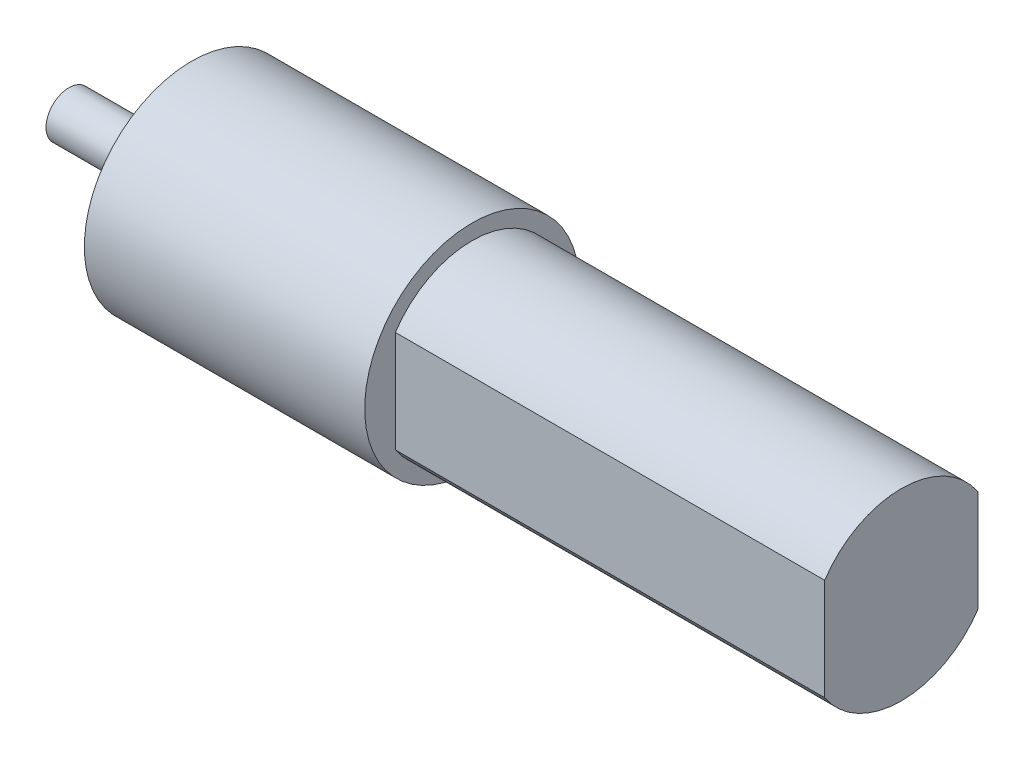
ISO-10303-21;
HEADER;
FILE_DESCRIPTION(('STEP AP214'),'2;1');
FILE_NAME('part.step','',(''),(''),'','','');
FILE_SCHEMA(('AUTOMOTIVE_DESIGN { 1 0 10303 214 1 1 1 1 }'));
ENDSEC;
DATA;
#1=APPLICATION_CONTEXT('core data for automotive mechanical design processes');
#2=APPLICATION_PROTOCOL_DEFINITION('international standard','automotive_design',2000,#1);
#3=PRODUCT_CONTEXT('',#1,'mechanical');
#4=PRODUCT('Part','Part','',(#3));
#5=PRODUCT_RELATED_PRODUCT_CATEGORY('part','',(#4));
#6=PRODUCT_DEFINITION_FORMATION('','',#4);
#7=PRODUCT_DEFINITION_CONTEXT('part definition',#1,'design');
#8=PRODUCT_DEFINITION('design','',#6,#7);
#9=PRODUCT_DEFINITION_SHAPE('','',#8);
#10=(LENGTH_UNIT() NAMED_UNIT(*) SI_UNIT(.MILLI.,.METRE.));
#11=(NAMED_UNIT(*) PLANE_ANGLE_UNIT() SI_UNIT($,.RADIAN.));
#12=(NAMED_UNIT(*) SI_UNIT($,.STERADIAN.) SOLID_ANGLE_UNIT());
#13=UNCERTAINTY_MEASURE_WITH_UNIT(LENGTH_MEASURE(1.E-05),#10,'distance_accuracy_value','');
#14=(GEOMETRIC_REPRESENTATION_CONTEXT(3) GLOBAL_UNCERTAINTY_ASSIGNED_CONTEXT((#13)) GLOBAL_UNIT_ASSIGNED_CONTEXT((#10,
#11,#12)) REPRESENTATION_CONTEXT('',''));
#15=CARTESIAN_POINT('',(0.,0.,0.));
#16=DIRECTION('',(0.,0.,1.));
#17=DIRECTION('',(1.,0.,0.));
#18=AXIS2_PLACEMENT_3D('',#15,#16,#17);
#19=CARTESIAN_POINT('',(-1.5875,0.,0.));
#20=DIRECTION('',(-1.,0.,0.));
#21=DIRECTION('',(0.,0.,1.));
#22=AXIS2_PLACEMENT_3D('',#19,#20,#21);
#23=PLANE('',#22);
#24=DIRECTION('',(0.,-1.,0.));
#25=VECTOR('',#24,1.);
#26=CARTESIAN_POINT('',(-1.5875,3.07418053105214,5.55625));
#27=LINE('',#26,#25);
#28=CARTESIAN_POINT('',(-1.5875,3.07418053105214,5.55625));
#29=VERTEX_POINT('',#28);
#30=CARTESIAN_POINT('',(-1.5875,-3.07418053105214,5.55625));
#31=VERTEX_POINT('',#30);
#32=EDGE_CURVE('E104',#29,#31,#27,.T.);
#33=ORIENTED_EDGE('',*,*,#32,.F.);
#34=CARTESIAN_POINT('',(-1.5875,0.,0.));
#35=DIRECTION('',(-1.,0.,0.));
#36=DIRECTION('',(0.,0.,1.));
#37=AXIS2_PLACEMENT_3D('',#34,#35,#36);
#38=CIRCLE('',#37,6.35);
#39=CARTESIAN_POINT('',(-1.5875,3.07418053105214,-5.55625));
#40=VERTEX_POINT('',#39);
#41=EDGE_CURVE('E111',#29,#40,#38,.T.);
#42=ORIENTED_EDGE('',*,*,#41,.T.);
#43=DIRECTION('',(0.,1.,0.));
#44=VECTOR('',#43,1.);
#45=CARTESIAN_POINT('',(-1.5875,3.07418053105214,-5.55625));
#46=LINE('',#45,#44);
#47=CARTESIAN_POINT('',(-1.5875,-3.07418053105214,-5.55625));
#48=VERTEX_POINT('',#47);
#49=EDGE_CURVE('E160',#48,#40,#46,.T.);
#50=ORIENTED_EDGE('',*,*,#49,.F.);
#51=EDGE_CURVE('E152',#48,#31,#38,.T.);
#52=ORIENTED_EDGE('',*,*,#51,.T.);
#53=EDGE_LOOP('',(#33,#42,#50,#52));
#54=FACE_BOUND('',#53,.T.);
#55=CARTESIAN_POINT('',(-1.5875,0.,0.));
#56=DIRECTION('',(-1.,0.,0.));
#57=DIRECTION('',(0.,0.,1.));
#58=AXIS2_PLACEMENT_3D('',#55,#56,#57);
#59=CIRCLE('',#58,2.38125);
#60=CARTESIAN_POINT('',(-1.5875,0.,2.38125));
#61=VERTEX_POINT('',#60);
#62=EDGE_CURVE('E166',#61,#61,#59,.T.);
#63=ORIENTED_EDGE('',*,*,#62,.F.);
#64=EDGE_LOOP('',(#63));
#65=FACE_BOUND('',#64,.T.);
#66=ADVANCED_FACE('F33',(#54,#65),#23,.T.);
#67=CARTESIAN_POINT('',(-1.5875,0.,0.));
#68=DIRECTION('',(1.,0.,0.));
#69=DIRECTION('',(0.,0.,-1.));
#70=AXIS2_PLACEMENT_3D('',#67,#68,#69);
#71=CYLINDRICAL_SURFACE('',#70,6.35);
#72=ORIENTED_EDGE('',*,*,#41,.F.);
#73=DIRECTION('',(-1.,0.,0.));
#74=VECTOR('',#73,1.);
#75=CARTESIAN_POINT('',(0.,3.07418053105214,5.55625));
#76=LINE('',#75,#74);
#77=CARTESIAN_POINT('',(0.,3.07418053105214,5.55625));
#78=VERTEX_POINT('',#77);
#79=EDGE_CURVE('E48',#78,#29,#76,.T.);
#80=ORIENTED_EDGE('',*,*,#79,.F.);
#81=CARTESIAN_POINT('',(0.,0.,0.));
#82=DIRECTION('',(1.,0.,0.));
#83=DIRECTION('',(0.,0.,-1.));
#84=AXIS2_PLACEMENT_3D('',#81,#82,#83);
#85=CIRCLE('',#84,6.35);
#86=CARTESIAN_POINT('',(0.,3.07418053105214,-5.55625));
#87=VERTEX_POINT('',#86);
#88=EDGE_CURVE('E41',#78,#87,#85,.F.);
#89=ORIENTED_EDGE('',*,*,#88,.T.);
#90=DIRECTION('',(-1.,0.,0.));
#91=VECTOR('',#90,1.);
#92=CARTESIAN_POINT('',(0.,3.07418053105214,-5.55625));
#93=LINE('',#92,#91);
#94=EDGE_CURVE('E158',#87,#40,#93,.T.);
#95=ORIENTED_EDGE('',*,*,#94,.T.);
#96=EDGE_LOOP('',(#72,#80,#89,#95));
#97=FACE_BOUND('',#96,.T.);
#98=ADVANCED_FACE('F108',(#97),#71,.T.);
#99=CARTESIAN_POINT('',(0.,0.,0.));
#100=DIRECTION('',(1.,0.,0.));
#101=DIRECTION('',(0.,0.,-1.));
#102=AXIS2_PLACEMENT_3D('',#99,#100,#101);
#103=PLANE('',#102);
#104=ORIENTED_EDGE('',*,*,#88,.F.);
#105=DIRECTION('',(0.,-1.,0.));
#106=VECTOR('',#105,1.);
#107=CARTESIAN_POINT('',(0.,3.07418053105214,5.55625));
#108=LINE('',#107,#106);
#109=CARTESIAN_POINT('',(0.,-3.07418053105214,5.55625));
#110=VERTEX_POINT('',#109);
#111=EDGE_CURVE('E97',#78,#110,#108,.T.);
#112=ORIENTED_EDGE('',*,*,#111,.T.);
#113=CARTESIAN_POINT('',(0.,-3.07418053105214,-5.55625));
#114=VERTEX_POINT('',#113);
#115=EDGE_CURVE('E11',#114,#110,#85,.F.);
#116=ORIENTED_EDGE('',*,*,#115,.F.);
#117=DIRECTION('',(0.,1.,0.));
#118=VECTOR('',#117,1.);
#119=CARTESIAN_POINT('',(0.,3.07418053105214,-5.55625));
#120=LINE('',#119,#118);
#121=EDGE_CURVE('E116',#114,#87,#120,.T.);
#122=ORIENTED_EDGE('',*,*,#121,.T.);
#123=EDGE_LOOP('',(#104,#112,#116,#122));
#124=FACE_BOUND('',#123,.T.);
#125=CARTESIAN_POINT('',(0.,0.,0.));
#126=DIRECTION('',(1.,0.,0.));
#127=DIRECTION('',(0.,0.,-1.));
#128=AXIS2_PLACEMENT_3D('',#125,#126,#127);
#129=CIRCLE('',#128,11.1125);
#130=CARTESIAN_POINT('',(0.,0.,-11.1125));
#131=VERTEX_POINT('',#130);
#132=EDGE_CURVE('E119',#131,#131,#129,.T.);
#133=ORIENTED_EDGE('',*,*,#132,.F.);
#134=EDGE_LOOP('',(#133));
#135=FACE_BOUND('',#134,.T.);
#136=ADVANCED_FACE('F114',(#124,#135),#103,.F.);
#137=CARTESIAN_POINT('',(73.4785714285714,0.,0.));
#138=DIRECTION('',(-1.,0.,0.));
#139=DIRECTION('',(0.,0.,1.));
#140=AXIS2_PLACEMENT_3D('',#137,#138,#139);
#141=CYLINDRICAL_SURFACE('',#140,9.525);
#142=CARTESIAN_POINT('',(73.4785714285714,0.,0.));
#143=DIRECTION('',(1.,0.,0.));
#144=DIRECTION('',(0.,0.,-1.));
#145=AXIS2_PLACEMENT_3D('',#142,#143,#144);
#146=CIRCLE('',#145,9.525);
#147=CARTESIAN_POINT('',(73.4785714285714,5.2651418546892,-7.9375));
#148=VERTEX_POINT('',#147);
#149=CARTESIAN_POINT('',(73.4785714285714,5.2651418546892,7.9375));
#150=VERTEX_POINT('',#149);
#151=EDGE_CURVE('E129',#148,#150,#146,.T.);
#152=ORIENTED_EDGE('',*,*,#151,.F.);
#153=DIRECTION('',(1.,0.,0.));
#154=VECTOR('',#153,1.);
#155=CARTESIAN_POINT('',(29.0285714285714,5.2651418546892,-7.9375));
#156=LINE('',#155,#154);
#157=CARTESIAN_POINT('',(29.0285714285714,5.2651418546892,-7.9375));
#158=VERTEX_POINT('',#157);
#159=EDGE_CURVE('E145',#158,#148,#156,.T.);
#160=ORIENTED_EDGE('',*,*,#159,.F.);
#161=CARTESIAN_POINT('',(29.0285714285714,0.,0.));
#162=DIRECTION('',(1.,0.,0.));
#163=DIRECTION('',(0.,0.,-1.));
#164=AXIS2_PLACEMENT_3D('',#161,#162,#163);
#165=CIRCLE('',#164,9.525);
#166=CARTESIAN_POINT('',(29.0285714285714,5.2651418546892,7.9375));
#167=VERTEX_POINT('',#166);
#168=EDGE_CURVE('E130',#158,#167,#165,.T.);
#169=ORIENTED_EDGE('',*,*,#168,.T.);
#170=DIRECTION('',(1.,0.,0.));
#171=VECTOR('',#170,1.);
#172=CARTESIAN_POINT('',(29.0285714285714,5.2651418546892,7.9375));
#173=LINE('',#172,#171);
#174=EDGE_CURVE('E135',#167,#150,#173,.T.);
#175=ORIENTED_EDGE('',*,*,#174,.T.);
#176=EDGE_LOOP('',(#152,#160,#169,#175));
#177=FACE_BOUND('',#176,.T.);
#178=ADVANCED_FACE('F210',(#177),#141,.T.);
#179=CARTESIAN_POINT('',(29.0285714285714,0.,0.));
#180=DIRECTION('',(1.,0.,0.));
#181=DIRECTION('',(0.,0.,-1.));
#182=AXIS2_PLACEMENT_3D('',#179,#180,#181);
#183=PLANE('',#182);
#184=ORIENTED_EDGE('',*,*,#168,.F.);
#185=DIRECTION('',(0.,-1.,0.));
#186=VECTOR('',#185,1.);
#187=CARTESIAN_POINT('',(29.0285714285714,5.2651418546892,-7.9375));
#188=LINE('',#187,#186);
#189=CARTESIAN_POINT('',(29.0285714285714,-5.2651418546892,-7.9375));
#190=VERTEX_POINT('',#189);
#191=EDGE_CURVE('E147',#158,#190,#188,.T.);
#192=ORIENTED_EDGE('',*,*,#191,.T.);
#193=CARTESIAN_POINT('',(29.0285714285714,-5.2651418546892,7.9375));
#194=VERTEX_POINT('',#193);
#195=EDGE_CURVE('E126',#194,#190,#165,.T.);
#196=ORIENTED_EDGE('',*,*,#195,.F.);
#197=DIRECTION('',(0.,1.,0.));
#198=VECTOR('',#197,1.);
#199=CARTESIAN_POINT('',(29.0285714285714,5.2651418546892,7.9375));
#200=LINE('',#199,#198);
#201=EDGE_CURVE('E136',#194,#167,#200,.T.);
#202=ORIENTED_EDGE('',*,*,#201,.T.);
#203=EDGE_LOOP('',(#184,#192,#196,#202));
#204=FACE_BOUND('',#203,.T.);
#205=CARTESIAN_POINT('',(29.0285714285714,0.,0.));
#206=DIRECTION('',(1.,0.,0.));
#207=DIRECTION('',(0.,0.,-1.));
#208=AXIS2_PLACEMENT_3D('',#205,#206,#207);
#209=CIRCLE('',#208,11.1125);
#210=CARTESIAN_POINT('',(29.0285714285714,0.,-11.1125));
#211=VERTEX_POINT('',#210);
#212=EDGE_CURVE('E117',#211,#211,#209,.T.);
#213=ORIENTED_EDGE('',*,*,#212,.T.);
#214=EDGE_LOOP('',(#213));
#215=FACE_BOUND('',#214,.T.);
#216=ADVANCED_FACE('F211',(#204,#215),#183,.T.);
#217=CARTESIAN_POINT('',(29.0285714285714,0.,0.));
#218=DIRECTION('',(-1.,0.,0.));
#219=DIRECTION('',(0.,0.,1.));
#220=AXIS2_PLACEMENT_3D('',#217,#218,#219);
#221=CYLINDRICAL_SURFACE('',#220,11.1125);
#222=ORIENTED_EDGE('',*,*,#212,.F.);
#223=EDGE_LOOP('',(#222));
#224=FACE_BOUND('',#223,.T.);
#225=ORIENTED_EDGE('',*,*,#132,.T.);
#226=EDGE_LOOP('',(#225));
#227=FACE_BOUND('',#226,.T.);
#228=ADVANCED_FACE('F35',(#224,#227),#221,.T.);
#229=ORIENTED_EDGE('',*,*,#195,.T.);
#230=DIRECTION('',(1.,0.,0.));
#231=VECTOR('',#230,1.);
#232=CARTESIAN_POINT('',(29.0285714285714,-5.2651418546892,-7.9375));
#233=LINE('',#232,#231);
#234=CARTESIAN_POINT('',(73.4785714285714,-5.2651418546892,-7.9375));
#235=VERTEX_POINT('',#234);
#236=EDGE_CURVE('E142',#190,#235,#233,.T.);
#237=ORIENTED_EDGE('',*,*,#236,.T.);
#238=CARTESIAN_POINT('',(73.4785714285714,-5.2651418546892,7.9375));
#239=VERTEX_POINT('',#238);
#240=EDGE_CURVE('E124',#239,#235,#146,.T.);
#241=ORIENTED_EDGE('',*,*,#240,.F.);
#242=DIRECTION('',(1.,0.,0.));
#243=VECTOR('',#242,1.);
#244=CARTESIAN_POINT('',(29.0285714285714,-5.2651418546892,7.9375));
#245=LINE('',#244,#243);
#246=EDGE_CURVE('E133',#194,#239,#245,.T.);
#247=ORIENTED_EDGE('',*,*,#246,.F.);
#248=EDGE_LOOP('',(#229,#237,#241,#247));
#249=FACE_BOUND('',#248,.T.);
#250=ADVANCED_FACE('F205',(#249),#141,.T.);
#251=CARTESIAN_POINT('',(73.4785714285714,0.,0.));
#252=DIRECTION('',(1.,0.,0.));
#253=DIRECTION('',(0.,0.,-1.));
#254=AXIS2_PLACEMENT_3D('',#251,#252,#253);
#255=PLANE('',#254);
#256=DIRECTION('',(0.,-1.,0.));
#257=VECTOR('',#256,1.);
#258=CARTESIAN_POINT('',(73.4785714285714,5.2651418546892,-7.9375));
#259=LINE('',#258,#257);
#260=EDGE_CURVE('E150',#148,#235,#259,.T.);
#261=ORIENTED_EDGE('',*,*,#260,.F.);
#262=ORIENTED_EDGE('',*,*,#151,.T.);
#263=DIRECTION('',(0.,1.,0.));
#264=VECTOR('',#263,1.);
#265=CARTESIAN_POINT('',(73.4785714285714,5.2651418546892,7.9375));
#266=LINE('',#265,#264);
#267=EDGE_CURVE('E139',#239,#150,#266,.T.);
#268=ORIENTED_EDGE('',*,*,#267,.F.);
#269=ORIENTED_EDGE('',*,*,#240,.T.);
#270=EDGE_LOOP('',(#261,#262,#268,#269));
#271=FACE_BOUND('',#270,.T.);
#272=ADVANCED_FACE('F201',(#271),#255,.T.);
#273=CARTESIAN_POINT('',(29.0285714285714,5.2651418546892,7.9375));
#274=DIRECTION('',(0.,0.,-1.));
#275=DIRECTION('',(-1.,0.,0.));
#276=AXIS2_PLACEMENT_3D('',#273,#274,#275);
#277=PLANE('',#276);
#278=ORIENTED_EDGE('',*,*,#267,.T.);
#279=ORIENTED_EDGE('',*,*,#174,.F.);
#280=ORIENTED_EDGE('',*,*,#201,.F.);
#281=ORIENTED_EDGE('',*,*,#246,.T.);
#282=EDGE_LOOP('',(#278,#279,#280,#281));
#283=FACE_BOUND('',#282,.T.);
#284=ADVANCED_FACE('F197',(#283),#277,.F.);
#285=CARTESIAN_POINT('',(29.0285714285714,5.2651418546892,-7.9375));
#286=DIRECTION('',(0.,0.,1.));
#287=DIRECTION('',(1.,0.,0.));
#288=AXIS2_PLACEMENT_3D('',#285,#286,#287);
#289=PLANE('',#288);
#290=ORIENTED_EDGE('',*,*,#260,.T.);
#291=ORIENTED_EDGE('',*,*,#236,.F.);
#292=ORIENTED_EDGE('',*,*,#191,.F.);
#293=ORIENTED_EDGE('',*,*,#159,.T.);
#294=EDGE_LOOP('',(#290,#291,#292,#293));
#295=FACE_BOUND('',#294,.T.);
#296=ADVANCED_FACE('F193',(#295),#289,.F.);
#297=ORIENTED_EDGE('',*,*,#115,.T.);
#298=DIRECTION('',(-1.,0.,0.));
#299=VECTOR('',#298,1.);
#300=CARTESIAN_POINT('',(0.,-3.07418053105214,5.55625));
#301=LINE('',#300,#299);
#302=EDGE_CURVE('E100',#110,#31,#301,.T.);
#303=ORIENTED_EDGE('',*,*,#302,.T.);
#304=ORIENTED_EDGE('',*,*,#51,.F.);
#305=DIRECTION('',(-1.,0.,0.));
#306=VECTOR('',#305,1.);
#307=CARTESIAN_POINT('',(0.,-3.07418053105214,-5.55625));
#308=LINE('',#307,#306);
#309=EDGE_CURVE('E56',#114,#48,#308,.T.);
#310=ORIENTED_EDGE('',*,*,#309,.F.);
#311=EDGE_LOOP('',(#297,#303,#304,#310));
#312=FACE_BOUND('',#311,.T.);
#313=ADVANCED_FACE('F187',(#312),#71,.T.);
#314=CARTESIAN_POINT('',(0.,3.07418053105214,-5.55625));
#315=DIRECTION('',(0.,0.,1.));
#316=DIRECTION('',(1.,0.,0.));
#317=AXIS2_PLACEMENT_3D('',#314,#315,#316);
#318=PLANE('',#317);
#319=ORIENTED_EDGE('',*,*,#49,.T.);
#320=ORIENTED_EDGE('',*,*,#94,.F.);
#321=ORIENTED_EDGE('',*,*,#121,.F.);
#322=ORIENTED_EDGE('',*,*,#309,.T.);
#323=EDGE_LOOP('',(#319,#320,#321,#322));
#324=FACE_BOUND('',#323,.T.);
#325=ADVANCED_FACE('F189',(#324),#318,.F.);
#326=CARTESIAN_POINT('',(0.,3.07418053105214,5.55625));
#327=DIRECTION('',(0.,0.,-1.));
#328=DIRECTION('',(-1.,0.,0.));
#329=AXIS2_PLACEMENT_3D('',#326,#327,#328);
#330=PLANE('',#329);
#331=ORIENTED_EDGE('',*,*,#32,.T.);
#332=ORIENTED_EDGE('',*,*,#302,.F.);
#333=ORIENTED_EDGE('',*,*,#111,.F.);
#334=ORIENTED_EDGE('',*,*,#79,.T.);
#335=EDGE_LOOP('',(#331,#332,#333,#334));
#336=FACE_BOUND('',#335,.T.);
#337=ADVANCED_FACE('F98',(#336),#330,.F.);
#338=CARTESIAN_POINT('',(-12.7,0.,0.));
#339=DIRECTION('',(1.,0.,0.));
#340=DIRECTION('',(0.,0.,-1.));
#341=AXIS2_PLACEMENT_3D('',#338,#339,#340);
#342=CYLINDRICAL_SURFACE('',#341,2.38125);
#343=CARTESIAN_POINT('',(-12.7,0.,0.));
#344=DIRECTION('',(-1.,0.,0.));
#345=DIRECTION('',(0.,0.,1.));
#346=AXIS2_PLACEMENT_3D('',#343,#344,#345);
#347=CIRCLE('',#346,2.38125);
#348=CARTESIAN_POINT('',(-12.7,0.,2.38125));
#349=VERTEX_POINT('',#348);
#350=EDGE_CURVE('E164',#349,#349,#347,.T.);
#351=ORIENTED_EDGE('',*,*,#350,.F.);
#352=EDGE_LOOP('',(#351));
#353=FACE_BOUND('',#352,.T.);
#354=ORIENTED_EDGE('',*,*,#62,.T.);
#355=EDGE_LOOP('',(#354));
#356=FACE_BOUND('',#355,.T.);
#357=ADVANCED_FACE('F174',(#353,#356),#342,.T.);
#358=CARTESIAN_POINT('',(-12.7,0.,0.));
#359=DIRECTION('',(-1.,0.,0.));
#360=DIRECTION('',(0.,0.,1.));
#361=AXIS2_PLACEMENT_3D('',#358,#359,#360);
#362=PLANE('',#361);
#363=ORIENTED_EDGE('',*,*,#350,.T.);
#364=EDGE_LOOP('',(#363));
#365=FACE_BOUND('',#364,.T.);
#366=ADVANCED_FACE('F172',(#365),#362,.T.);
#367=CLOSED_SHELL('',(#66,#98,#136,#178,#216,#228,#250,#272,#284,#296,#313,#325,#337,#357,#366));
#368=MANIFOLD_SOLID_BREP('B2',#367);
#369=ADVANCED_BREP_SHAPE_REPRESENTATION('',(#18,#368),#14);
#370=SHAPE_DEFINITION_REPRESENTATION(#9,#369);
ENDSEC;
END-ISO-10303-21;
